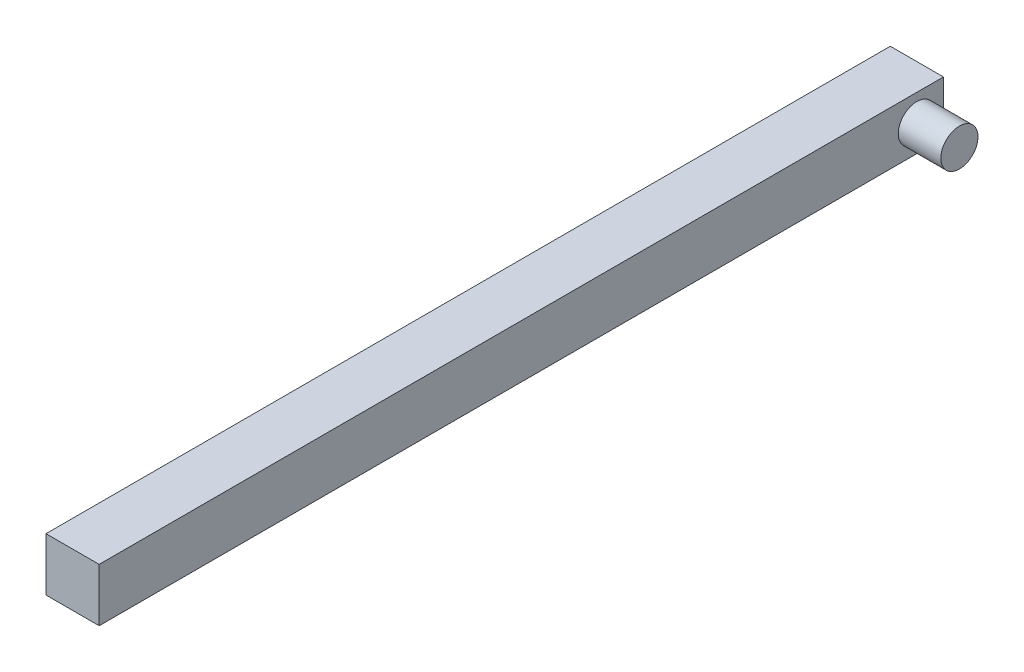
ISO-10303-21;
HEADER;
FILE_DESCRIPTION(('STEP AP214'),'2;1');
FILE_NAME('part.step','',(''),(''),'','','');
FILE_SCHEMA(('AUTOMOTIVE_DESIGN { 1 0 10303 214 1 1 1 1 }'));
ENDSEC;
DATA;
#1=APPLICATION_CONTEXT('core data for automotive mechanical design processes');
#2=APPLICATION_PROTOCOL_DEFINITION('international standard','automotive_design',2000,#1);
#3=PRODUCT_CONTEXT('',#1,'mechanical');
#4=PRODUCT('Part','Part','',(#3));
#5=PRODUCT_RELATED_PRODUCT_CATEGORY('part','',(#4));
#6=PRODUCT_DEFINITION_FORMATION('','',#4);
#7=PRODUCT_DEFINITION_CONTEXT('part definition',#1,'design');
#8=PRODUCT_DEFINITION('design','',#6,#7);
#9=PRODUCT_DEFINITION_SHAPE('','',#8);
#10=(LENGTH_UNIT() NAMED_UNIT(*) SI_UNIT(.MILLI.,.METRE.));
#11=(NAMED_UNIT(*) PLANE_ANGLE_UNIT() SI_UNIT($,.RADIAN.));
#12=(NAMED_UNIT(*) SI_UNIT($,.STERADIAN.) SOLID_ANGLE_UNIT());
#13=UNCERTAINTY_MEASURE_WITH_UNIT(LENGTH_MEASURE(1.E-05),#10,'distance_accuracy_value','');
#14=(GEOMETRIC_REPRESENTATION_CONTEXT(3) GLOBAL_UNCERTAINTY_ASSIGNED_CONTEXT((#13)) GLOBAL_UNIT_ASSIGNED_CONTEXT((#10,
#11,#12)) REPRESENTATION_CONTEXT('',''));
#15=CARTESIAN_POINT('',(0.,0.,0.));
#16=DIRECTION('',(0.,0.,1.));
#17=DIRECTION('',(1.,0.,0.));
#18=AXIS2_PLACEMENT_3D('',#15,#16,#17);
#19=CARTESIAN_POINT('',(0.,0.,158.8));
#20=DIRECTION('',(1.,0.,0.));
#21=DIRECTION('',(0.,0.,-1.));
#22=AXIS2_PLACEMENT_3D('',#19,#20,#21);
#23=PLANE('',#22);
#24=DIRECTION('',(0.,1.,0.));
#25=VECTOR('',#24,1.);
#26=CARTESIAN_POINT('',(0.,-8.97,158.8));
#27=LINE('',#26,#25);
#28=CARTESIAN_POINT('',(0.,0.,158.8));
#29=VERTEX_POINT('',#28);
#30=CARTESIAN_POINT('',(0.,10.,158.8));
#31=VERTEX_POINT('',#30);
#32=EDGE_CURVE('E113',#29,#31,#27,.T.);
#33=ORIENTED_EDGE('',*,*,#32,.T.);
#34=DIRECTION('',(0.,0.,-1.));
#35=VECTOR('',#34,1.);
#36=CARTESIAN_POINT('',(0.,10.,158.8));
#37=LINE('',#36,#35);
#38=CARTESIAN_POINT('',(0.,10.,0.));
#39=VERTEX_POINT('',#38);
#40=EDGE_CURVE('E90',#31,#39,#37,.T.);
#41=ORIENTED_EDGE('',*,*,#40,.T.);
#42=DIRECTION('',(0.,-1.,0.));
#43=VECTOR('',#42,1.);
#44=CARTESIAN_POINT('',(0.,0.,0.));
#45=LINE('',#44,#43);
#46=CARTESIAN_POINT('',(0.,0.,0.));
#47=VERTEX_POINT('',#46);
#48=EDGE_CURVE('E95',#39,#47,#45,.T.);
#49=ORIENTED_EDGE('',*,*,#48,.T.);
#50=DIRECTION('',(0.,0.,-1.));
#51=VECTOR('',#50,1.);
#52=CARTESIAN_POINT('',(0.,0.,158.8));
#53=LINE('',#52,#51);
#54=EDGE_CURVE('E49',#29,#47,#53,.T.);
#55=ORIENTED_EDGE('',*,*,#54,.F.);
#56=EDGE_LOOP('',(#33,#41,#49,#55));
#57=FACE_BOUND('',#56,.T.);
#58=ADVANCED_FACE('F41',(#57),#23,.F.);
#59=CARTESIAN_POINT('',(0.,0.,158.8));
#60=DIRECTION('',(0.,1.,0.));
#61=DIRECTION('',(0.,0.,1.));
#62=AXIS2_PLACEMENT_3D('',#59,#60,#61);
#63=PLANE('',#62);
#64=DIRECTION('',(1.,0.,0.));
#65=VECTOR('',#64,1.);
#66=CARTESIAN_POINT('',(0.,0.,0.));
#67=LINE('',#66,#65);
#68=CARTESIAN_POINT('',(10.,0.,0.));
#69=VERTEX_POINT('',#68);
#70=EDGE_CURVE('E83',#47,#69,#67,.T.);
#71=ORIENTED_EDGE('',*,*,#70,.T.);
#72=DIRECTION('',(0.,0.,-1.));
#73=VECTOR('',#72,1.);
#74=CARTESIAN_POINT('',(10.,0.,158.8));
#75=LINE('',#74,#73);
#76=CARTESIAN_POINT('',(10.,0.,158.8));
#77=VERTEX_POINT('',#76);
#78=EDGE_CURVE('E79',#77,#69,#75,.T.);
#79=ORIENTED_EDGE('',*,*,#78,.F.);
#80=DIRECTION('',(1.,0.,0.));
#81=VECTOR('',#80,1.);
#82=CARTESIAN_POINT('',(0.,0.,158.8));
#83=LINE('',#82,#81);
#84=EDGE_CURVE('E96',#29,#77,#83,.T.);
#85=ORIENTED_EDGE('',*,*,#84,.F.);
#86=ORIENTED_EDGE('',*,*,#54,.T.);
#87=EDGE_LOOP('',(#71,#79,#85,#86));
#88=FACE_BOUND('',#87,.T.);
#89=ADVANCED_FACE('F106',(#88),#63,.F.);
#90=CARTESIAN_POINT('',(10.,0.,158.8));
#91=DIRECTION('',(-1.,0.,0.));
#92=DIRECTION('',(0.,0.,1.));
#93=AXIS2_PLACEMENT_3D('',#90,#91,#92);
#94=PLANE('',#93);
#95=CARTESIAN_POINT('',(10.,5.,5.));
#96=DIRECTION('',(-1.,0.,0.));
#97=DIRECTION('',(0.,0.,1.));
#98=AXIS2_PLACEMENT_3D('',#95,#96,#97);
#99=CIRCLE('',#98,3.5);
#100=CARTESIAN_POINT('',(10.,5.,8.5));
#101=VERTEX_POINT('',#100);
#102=EDGE_CURVE('E11',#101,#101,#99,.F.);
#103=ORIENTED_EDGE('',*,*,#102,.F.);
#104=EDGE_LOOP('',(#103));
#105=FACE_BOUND('',#104,.T.);
#106=DIRECTION('',(0.,1.,0.));
#107=VECTOR('',#106,1.);
#108=CARTESIAN_POINT('',(10.,0.,0.));
#109=LINE('',#108,#107);
#110=CARTESIAN_POINT('',(10.,10.,0.));
#111=VERTEX_POINT('',#110);
#112=EDGE_CURVE('E73',#69,#111,#109,.T.);
#113=ORIENTED_EDGE('',*,*,#112,.T.);
#114=DIRECTION('',(0.,0.,-1.));
#115=VECTOR('',#114,1.);
#116=CARTESIAN_POINT('',(10.,10.,158.8));
#117=LINE('',#116,#115);
#118=CARTESIAN_POINT('',(10.,10.,158.8));
#119=VERTEX_POINT('',#118);
#120=EDGE_CURVE('E76',#119,#111,#117,.T.);
#121=ORIENTED_EDGE('',*,*,#120,.F.);
#122=DIRECTION('',(0.,1.,0.));
#123=VECTOR('',#122,1.);
#124=CARTESIAN_POINT('',(10.,0.,158.8));
#125=LINE('',#124,#123);
#126=EDGE_CURVE('E56',#77,#119,#125,.T.);
#127=ORIENTED_EDGE('',*,*,#126,.F.);
#128=ORIENTED_EDGE('',*,*,#78,.T.);
#129=EDGE_LOOP('',(#113,#121,#127,#128));
#130=FACE_BOUND('',#129,.T.);
#131=ADVANCED_FACE('F75',(#105,#130),#94,.F.);
#132=CARTESIAN_POINT('',(0.,10.,158.8));
#133=DIRECTION('',(0.,-1.,0.));
#134=DIRECTION('',(0.,0.,-1.));
#135=AXIS2_PLACEMENT_3D('',#132,#133,#134);
#136=PLANE('',#135);
#137=DIRECTION('',(-1.,0.,0.));
#138=VECTOR('',#137,1.);
#139=CARTESIAN_POINT('',(0.,10.,0.));
#140=LINE('',#139,#138);
#141=EDGE_CURVE('E82',#111,#39,#140,.T.);
#142=ORIENTED_EDGE('',*,*,#141,.T.);
#143=ORIENTED_EDGE('',*,*,#40,.F.);
#144=DIRECTION('',(-1.,0.,0.));
#145=VECTOR('',#144,1.);
#146=CARTESIAN_POINT('',(0.,10.,158.8));
#147=LINE('',#146,#145);
#148=EDGE_CURVE('E89',#119,#31,#147,.T.);
#149=ORIENTED_EDGE('',*,*,#148,.F.);
#150=ORIENTED_EDGE('',*,*,#120,.T.);
#151=EDGE_LOOP('',(#142,#143,#149,#150));
#152=FACE_BOUND('',#151,.T.);
#153=ADVANCED_FACE('F86',(#152),#136,.F.);
#154=CARTESIAN_POINT('',(0.,0.,0.));
#155=DIRECTION('',(0.,0.,-1.));
#156=DIRECTION('',(-1.,0.,0.));
#157=AXIS2_PLACEMENT_3D('',#154,#155,#156);
#158=PLANE('',#157);
#159=ORIENTED_EDGE('',*,*,#48,.F.);
#160=ORIENTED_EDGE('',*,*,#141,.F.);
#161=ORIENTED_EDGE('',*,*,#112,.F.);
#162=ORIENTED_EDGE('',*,*,#70,.F.);
#163=EDGE_LOOP('',(#159,#160,#161,#162));
#164=FACE_BOUND('',#163,.T.);
#165=ADVANCED_FACE('F93',(#164),#158,.T.);
#166=CARTESIAN_POINT('',(18.,5.,5.));
#167=DIRECTION('',(-1.,0.,0.));
#168=DIRECTION('',(0.,0.,1.));
#169=AXIS2_PLACEMENT_3D('',#166,#167,#168);
#170=CYLINDRICAL_SURFACE('',#169,3.5);
#171=CARTESIAN_POINT('',(18.,5.,5.));
#172=DIRECTION('',(1.,0.,0.));
#173=DIRECTION('',(0.,0.,-1.));
#174=AXIS2_PLACEMENT_3D('',#171,#172,#173);
#175=CIRCLE('',#174,3.5);
#176=CARTESIAN_POINT('',(18.,5.,1.5));
#177=VERTEX_POINT('',#176);
#178=EDGE_CURVE('E110',#177,#177,#175,.T.);
#179=ORIENTED_EDGE('',*,*,#178,.F.);
#180=EDGE_LOOP('',(#179));
#181=FACE_BOUND('',#180,.T.);
#182=ORIENTED_EDGE('',*,*,#102,.T.);
#183=EDGE_LOOP('',(#182));
#184=FACE_BOUND('',#183,.T.);
#185=ADVANCED_FACE('F129',(#181,#184),#170,.T.);
#186=CARTESIAN_POINT('',(18.,5.,5.));
#187=DIRECTION('',(1.,0.,0.));
#188=DIRECTION('',(0.,0.,-1.));
#189=AXIS2_PLACEMENT_3D('',#186,#187,#188);
#190=PLANE('',#189);
#191=ORIENTED_EDGE('',*,*,#178,.T.);
#192=EDGE_LOOP('',(#191));
#193=FACE_BOUND('',#192,.T.);
#194=ADVANCED_FACE('F123',(#193),#190,.T.);
#195=CARTESIAN_POINT('',(0.,0.,158.8));
#196=DIRECTION('',(0.,0.,1.));
#197=DIRECTION('',(1.,0.,0.));
#198=AXIS2_PLACEMENT_3D('',#195,#196,#197);
#199=PLANE('',#198);
#200=ORIENTED_EDGE('',*,*,#84,.T.);
#201=ORIENTED_EDGE('',*,*,#126,.T.);
#202=ORIENTED_EDGE('',*,*,#148,.T.);
#203=ORIENTED_EDGE('',*,*,#32,.F.);
#204=EDGE_LOOP('',(#200,#201,#202,#203));
#205=FACE_BOUND('',#204,.T.);
#206=ADVANCED_FACE('F120',(#205),#199,.T.);
#207=CLOSED_SHELL('',(#58,#89,#131,#153,#165,#185,#194,#206));
#208=MANIFOLD_SOLID_BREP('B2',#207);
#209=ADVANCED_BREP_SHAPE_REPRESENTATION('',(#18,#208),#14);
#210=SHAPE_DEFINITION_REPRESENTATION(#9,#209);
ENDSEC;
END-ISO-10303-21;
